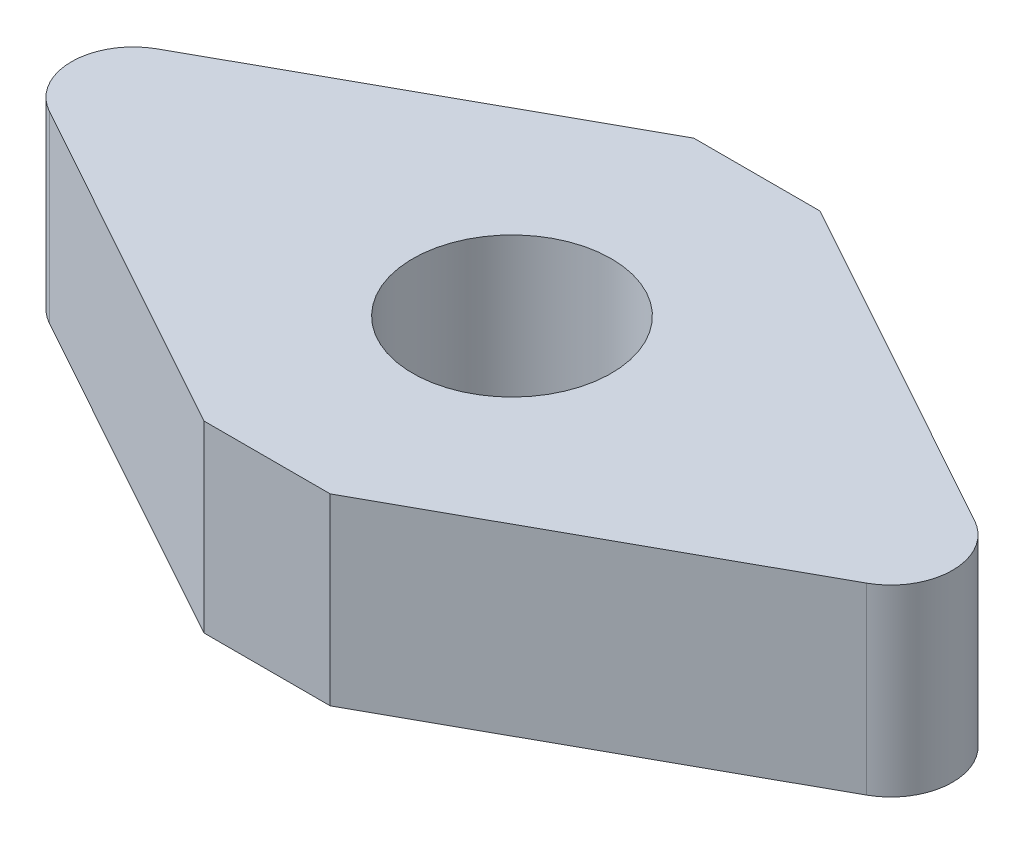
ISO-10303-21;
HEADER;
FILE_DESCRIPTION(('STEP AP214'),'2;1');
FILE_NAME('part.step','',(''),(''),'','','');
FILE_SCHEMA(('AUTOMOTIVE_DESIGN { 1 0 10303 214 1 1 1 1 }'));
ENDSEC;
DATA;
#1=APPLICATION_CONTEXT('core data for automotive mechanical design processes');
#2=APPLICATION_PROTOCOL_DEFINITION('international standard','automotive_design',2000,#1);
#3=PRODUCT_CONTEXT('',#1,'mechanical');
#4=PRODUCT('Part','Part','',(#3));
#5=PRODUCT_RELATED_PRODUCT_CATEGORY('part','',(#4));
#6=PRODUCT_DEFINITION_FORMATION('','',#4);
#7=PRODUCT_DEFINITION_CONTEXT('part definition',#1,'design');
#8=PRODUCT_DEFINITION('design','',#6,#7);
#9=PRODUCT_DEFINITION_SHAPE('','',#8);
#10=(LENGTH_UNIT() NAMED_UNIT(*) SI_UNIT(.MILLI.,.METRE.));
#11=(NAMED_UNIT(*) PLANE_ANGLE_UNIT() SI_UNIT($,.RADIAN.));
#12=(NAMED_UNIT(*) SI_UNIT($,.STERADIAN.) SOLID_ANGLE_UNIT());
#13=UNCERTAINTY_MEASURE_WITH_UNIT(LENGTH_MEASURE(1.E-05),#10,'distance_accuracy_value','');
#14=(GEOMETRIC_REPRESENTATION_CONTEXT(3) GLOBAL_UNCERTAINTY_ASSIGNED_CONTEXT((#13)) GLOBAL_UNIT_ASSIGNED_CONTEXT((#10,
#11,#12)) REPRESENTATION_CONTEXT('',''));
#15=CARTESIAN_POINT('',(0.,0.,0.));
#16=DIRECTION('',(0.,0.,1.));
#17=DIRECTION('',(1.,0.,0.));
#18=AXIS2_PLACEMENT_3D('',#15,#16,#17);
#19=CARTESIAN_POINT('',(-9.82071370639021,4.76,0.));
#20=DIRECTION('',(0.,-1.,0.));
#21=DIRECTION('',(0.,0.,-1.));
#22=AXIS2_PLACEMENT_3D('',#19,#20,#21);
#23=CYLINDRICAL_SURFACE('',#22,1.6);
#24=CARTESIAN_POINT('',(-9.82071370639021,0.,0.));
#25=DIRECTION('',(0.,1.,0.));
#26=DIRECTION('',(0.,0.,-1.));
#27=AXIS2_PLACEMENT_3D('',#24,#25,#26);
#28=CIRCLE('',#27,1.6);
#29=CARTESIAN_POINT('',(-10.5945882156384,0.,-1.40039931588667));
#30=VERTEX_POINT('',#29);
#31=CARTESIAN_POINT('',(-10.5945882156384,0.,1.40039931588667));
#32=VERTEX_POINT('',#31);
#33=EDGE_CURVE('E153',#30,#32,#28,.T.);
#34=ORIENTED_EDGE('',*,*,#33,.T.);
#35=DIRECTION('',(0.,-1.,0.));
#36=VECTOR('',#35,1.);
#37=CARTESIAN_POINT('',(-10.5945882156384,4.76,1.40039931588667));
#38=LINE('',#37,#36);
#39=CARTESIAN_POINT('',(-10.5945882156384,4.76,1.40039931588667));
#40=VERTEX_POINT('',#39);
#41=EDGE_CURVE('E11',#40,#32,#38,.T.);
#42=ORIENTED_EDGE('',*,*,#41,.F.);
#43=CARTESIAN_POINT('',(-9.82071370639021,4.76,0.));
#44=DIRECTION('',(0.,1.,0.));
#45=DIRECTION('',(0.,0.,-1.));
#46=AXIS2_PLACEMENT_3D('',#43,#44,#45);
#47=CIRCLE('',#46,1.6);
#48=CARTESIAN_POINT('',(-10.5945882156384,4.76,-1.40039931588667));
#49=VERTEX_POINT('',#48);
#50=EDGE_CURVE('E174',#49,#40,#47,.T.);
#51=ORIENTED_EDGE('',*,*,#50,.F.);
#52=DIRECTION('',(0.,-1.,0.));
#53=VECTOR('',#52,1.);
#54=CARTESIAN_POINT('',(-10.5945882156384,4.76,-1.40039931588667));
#55=LINE('',#54,#53);
#56=EDGE_CURVE('E149',#49,#30,#55,.T.);
#57=ORIENTED_EDGE('',*,*,#56,.T.);
#58=EDGE_LOOP('',(#34,#42,#51,#57));
#59=FACE_BOUND('',#58,.T.);
#60=ADVANCED_FACE('F39',(#59),#23,.T.);
#61=CARTESIAN_POINT('',(-1.63781637587595,4.76,6.35000000000001));
#62=DIRECTION('',(0.483671568280138,0.,-0.875249572429162));
#63=DIRECTION('',(-0.875249572429163,0.,-0.483671568280138));
#64=AXIS2_PLACEMENT_3D('',#61,#62,#63);
#65=PLANE('',#64);
#66=DIRECTION('',(0.875249572429163,0.,0.483671568280138));
#67=VECTOR('',#66,1.);
#68=CARTESIAN_POINT('',(-1.63781637587595,0.,6.35000000000001));
#69=LINE('',#68,#67);
#70=CARTESIAN_POINT('',(-1.63781637587595,0.,6.35000000000001));
#71=VERTEX_POINT('',#70);
#72=EDGE_CURVE('E156',#32,#71,#69,.T.);
#73=ORIENTED_EDGE('',*,*,#72,.T.);
#74=DIRECTION('',(0.,-1.,0.));
#75=VECTOR('',#74,1.);
#76=CARTESIAN_POINT('',(-1.63781637587595,4.76,6.35000000000001));
#77=LINE('',#76,#75);
#78=CARTESIAN_POINT('',(-1.63781637587595,4.76,6.35000000000001));
#79=VERTEX_POINT('',#78);
#80=EDGE_CURVE('E48',#79,#71,#77,.T.);
#81=ORIENTED_EDGE('',*,*,#80,.F.);
#82=DIRECTION('',(0.875249572429163,0.,0.483671568280138));
#83=VECTOR('',#82,1.);
#84=CARTESIAN_POINT('',(-1.63781637587595,4.76,6.35000000000001));
#85=LINE('',#84,#83);
#86=EDGE_CURVE('E108',#40,#79,#85,.T.);
#87=ORIENTED_EDGE('',*,*,#86,.F.);
#88=ORIENTED_EDGE('',*,*,#41,.T.);
#89=EDGE_LOOP('',(#73,#81,#87,#88));
#90=FACE_BOUND('',#89,.T.);
#91=ADVANCED_FACE('F241',(#90),#65,.F.);
#92=CARTESIAN_POINT('',(1.63781637587596,4.76,6.35000000000001));
#93=DIRECTION('',(0.,0.,-1.));
#94=DIRECTION('',(-1.,0.,0.));
#95=AXIS2_PLACEMENT_3D('',#92,#93,#94);
#96=PLANE('',#95);
#97=DIRECTION('',(1.,0.,0.));
#98=VECTOR('',#97,1.);
#99=CARTESIAN_POINT('',(1.63781637587596,0.,6.35000000000001));
#100=LINE('',#99,#98);
#101=CARTESIAN_POINT('',(1.63781637587596,0.,6.35000000000001));
#102=VERTEX_POINT('',#101);
#103=EDGE_CURVE('E160',#71,#102,#100,.T.);
#104=ORIENTED_EDGE('',*,*,#103,.T.);
#105=DIRECTION('',(0.,-1.,0.));
#106=VECTOR('',#105,1.);
#107=CARTESIAN_POINT('',(1.63781637587596,4.76,6.35000000000001));
#108=LINE('',#107,#106);
#109=CARTESIAN_POINT('',(1.63781637587596,4.76,6.35000000000001));
#110=VERTEX_POINT('',#109);
#111=EDGE_CURVE('E185',#110,#102,#108,.T.);
#112=ORIENTED_EDGE('',*,*,#111,.F.);
#113=DIRECTION('',(1.,0.,0.));
#114=VECTOR('',#113,1.);
#115=CARTESIAN_POINT('',(1.63781637587596,4.76,6.35000000000001));
#116=LINE('',#115,#114);
#117=EDGE_CURVE('E196',#79,#110,#116,.T.);
#118=ORIENTED_EDGE('',*,*,#117,.F.);
#119=ORIENTED_EDGE('',*,*,#80,.T.);
#120=EDGE_LOOP('',(#104,#112,#118,#119));
#121=FACE_BOUND('',#120,.T.);
#122=ADVANCED_FACE('F194',(#121),#96,.F.);
#123=CARTESIAN_POINT('',(10.5945882156384,4.76,1.40039931588667));
#124=DIRECTION('',(-0.483671568280138,0.,-0.875249572429162));
#125=DIRECTION('',(-0.875249572429163,0.,0.483671568280138));
#126=AXIS2_PLACEMENT_3D('',#123,#124,#125);
#127=PLANE('',#126);
#128=DIRECTION('',(0.875249572429162,0.,-0.483671568280138));
#129=VECTOR('',#128,1.);
#130=CARTESIAN_POINT('',(10.5945882156384,0.,1.40039931588667));
#131=LINE('',#130,#129);
#132=CARTESIAN_POINT('',(10.5945882156384,0.,1.40039931588667));
#133=VERTEX_POINT('',#132);
#134=EDGE_CURVE('E162',#102,#133,#131,.T.);
#135=ORIENTED_EDGE('',*,*,#134,.T.);
#136=DIRECTION('',(0.,-1.,0.));
#137=VECTOR('',#136,1.);
#138=CARTESIAN_POINT('',(10.5945882156384,4.76,1.40039931588667));
#139=LINE('',#138,#137);
#140=CARTESIAN_POINT('',(10.5945882156384,4.76,1.40039931588667));
#141=VERTEX_POINT('',#140);
#142=EDGE_CURVE('E181',#141,#133,#139,.T.);
#143=ORIENTED_EDGE('',*,*,#142,.F.);
#144=DIRECTION('',(0.875249572429162,0.,-0.483671568280138));
#145=VECTOR('',#144,1.);
#146=CARTESIAN_POINT('',(10.5945882156384,4.76,1.40039931588667));
#147=LINE('',#146,#145);
#148=EDGE_CURVE('E209',#110,#141,#147,.T.);
#149=ORIENTED_EDGE('',*,*,#148,.F.);
#150=ORIENTED_EDGE('',*,*,#111,.T.);
#151=EDGE_LOOP('',(#135,#143,#149,#150));
#152=FACE_BOUND('',#151,.T.);
#153=ADVANCED_FACE('F204',(#152),#127,.F.);
#154=CARTESIAN_POINT('',(9.82071370639021,4.76,0.));
#155=DIRECTION('',(0.,-1.,0.));
#156=DIRECTION('',(0.,0.,-1.));
#157=AXIS2_PLACEMENT_3D('',#154,#155,#156);
#158=CYLINDRICAL_SURFACE('',#157,1.6);
#159=CARTESIAN_POINT('',(9.82071370639021,0.,0.));
#160=DIRECTION('',(0.,1.,0.));
#161=DIRECTION('',(0.,0.,1.));
#162=AXIS2_PLACEMENT_3D('',#159,#160,#161);
#163=CIRCLE('',#162,1.6);
#164=CARTESIAN_POINT('',(10.5945882156384,0.,-1.40039931588667));
#165=VERTEX_POINT('',#164);
#166=EDGE_CURVE('E165',#133,#165,#163,.T.);
#167=ORIENTED_EDGE('',*,*,#166,.T.);
#168=DIRECTION('',(0.,-1.,0.));
#169=VECTOR('',#168,1.);
#170=CARTESIAN_POINT('',(10.5945882156384,4.76,-1.40039931588667));
#171=LINE('',#170,#169);
#172=CARTESIAN_POINT('',(10.5945882156384,4.76,-1.40039931588667));
#173=VERTEX_POINT('',#172);
#174=EDGE_CURVE('E141',#173,#165,#171,.T.);
#175=ORIENTED_EDGE('',*,*,#174,.F.);
#176=CARTESIAN_POINT('',(9.82071370639021,4.76,0.));
#177=DIRECTION('',(0.,1.,0.));
#178=DIRECTION('',(0.,0.,1.));
#179=AXIS2_PLACEMENT_3D('',#176,#177,#178);
#180=CIRCLE('',#179,1.6);
#181=EDGE_CURVE('E130',#141,#173,#180,.T.);
#182=ORIENTED_EDGE('',*,*,#181,.F.);
#183=ORIENTED_EDGE('',*,*,#142,.T.);
#184=EDGE_LOOP('',(#167,#175,#182,#183));
#185=FACE_BOUND('',#184,.T.);
#186=ADVANCED_FACE('F207',(#185),#158,.T.);
#187=CARTESIAN_POINT('',(1.63781637587596,4.76,-6.35000000000001));
#188=DIRECTION('',(-0.483671568280139,0.,0.875249572429162));
#189=DIRECTION('',(0.875249572429162,0.,0.483671568280139));
#190=AXIS2_PLACEMENT_3D('',#187,#188,#189);
#191=PLANE('',#190);
#192=DIRECTION('',(-0.875249572429162,0.,-0.483671568280138));
#193=VECTOR('',#192,1.);
#194=CARTESIAN_POINT('',(1.63781637587596,0.,-6.35000000000001));
#195=LINE('',#194,#193);
#196=CARTESIAN_POINT('',(1.63781637587596,0.,-6.35000000000001));
#197=VERTEX_POINT('',#196);
#198=EDGE_CURVE('E139',#165,#197,#195,.T.);
#199=ORIENTED_EDGE('',*,*,#198,.T.);
#200=DIRECTION('',(0.,-1.,0.));
#201=VECTOR('',#200,1.);
#202=CARTESIAN_POINT('',(1.63781637587596,4.76,-6.35000000000001));
#203=LINE('',#202,#201);
#204=CARTESIAN_POINT('',(1.63781637587596,4.76,-6.35000000000001));
#205=VERTEX_POINT('',#204);
#206=EDGE_CURVE('E136',#205,#197,#203,.T.);
#207=ORIENTED_EDGE('',*,*,#206,.F.);
#208=DIRECTION('',(-0.875249572429162,0.,-0.483671568280138));
#209=VECTOR('',#208,1.);
#210=CARTESIAN_POINT('',(1.63781637587596,4.76,-6.35000000000001));
#211=LINE('',#210,#209);
#212=EDGE_CURVE('E124',#173,#205,#211,.T.);
#213=ORIENTED_EDGE('',*,*,#212,.F.);
#214=ORIENTED_EDGE('',*,*,#174,.T.);
#215=EDGE_LOOP('',(#199,#207,#213,#214));
#216=FACE_BOUND('',#215,.T.);
#217=ADVANCED_FACE('F137',(#216),#191,.F.);
#218=CARTESIAN_POINT('',(-1.63781637587595,4.76,-6.35000000000001));
#219=DIRECTION('',(0.,0.,1.));
#220=DIRECTION('',(1.,0.,0.));
#221=AXIS2_PLACEMENT_3D('',#218,#219,#220);
#222=PLANE('',#221);
#223=DIRECTION('',(-1.,0.,0.));
#224=VECTOR('',#223,1.);
#225=CARTESIAN_POINT('',(-1.63781637587595,0.,-6.35000000000001));
#226=LINE('',#225,#224);
#227=CARTESIAN_POINT('',(-1.63781637587595,0.,-6.35000000000001));
#228=VERTEX_POINT('',#227);
#229=EDGE_CURVE('E94',#197,#228,#226,.T.);
#230=ORIENTED_EDGE('',*,*,#229,.T.);
#231=DIRECTION('',(0.,-1.,0.));
#232=VECTOR('',#231,1.);
#233=CARTESIAN_POINT('',(-1.63781637587595,4.76,-6.35000000000001));
#234=LINE('',#233,#232);
#235=CARTESIAN_POINT('',(-1.63781637587595,4.76,-6.35000000000001));
#236=VERTEX_POINT('',#235);
#237=EDGE_CURVE('E142',#236,#228,#234,.T.);
#238=ORIENTED_EDGE('',*,*,#237,.F.);
#239=DIRECTION('',(-1.,0.,0.));
#240=VECTOR('',#239,1.);
#241=CARTESIAN_POINT('',(-1.63781637587595,4.76,-6.35000000000001));
#242=LINE('',#241,#240);
#243=EDGE_CURVE('E128',#205,#236,#242,.T.);
#244=ORIENTED_EDGE('',*,*,#243,.F.);
#245=ORIENTED_EDGE('',*,*,#206,.T.);
#246=EDGE_LOOP('',(#230,#238,#244,#245));
#247=FACE_BOUND('',#246,.T.);
#248=ADVANCED_FACE('F144',(#247),#222,.F.);
#249=CARTESIAN_POINT('',(-10.5945882156384,4.76,-1.40039931588667));
#250=DIRECTION('',(0.483671568280138,0.,0.875249572429162));
#251=DIRECTION('',(0.875249572429163,0.,-0.483671568280138));
#252=AXIS2_PLACEMENT_3D('',#249,#250,#251);
#253=PLANE('',#252);
#254=DIRECTION('',(-0.875249572429163,0.,0.483671568280138));
#255=VECTOR('',#254,1.);
#256=CARTESIAN_POINT('',(-10.5945882156384,0.,-1.40039931588667));
#257=LINE('',#256,#255);
#258=EDGE_CURVE('E100',#228,#30,#257,.T.);
#259=ORIENTED_EDGE('',*,*,#258,.T.);
#260=ORIENTED_EDGE('',*,*,#56,.F.);
#261=DIRECTION('',(-0.875249572429163,0.,0.483671568280138));
#262=VECTOR('',#261,1.);
#263=CARTESIAN_POINT('',(-10.5945882156384,4.76,-1.40039931588667));
#264=LINE('',#263,#262);
#265=EDGE_CURVE('E59',#236,#49,#264,.T.);
#266=ORIENTED_EDGE('',*,*,#265,.F.);
#267=ORIENTED_EDGE('',*,*,#237,.T.);
#268=EDGE_LOOP('',(#259,#260,#266,#267));
#269=FACE_BOUND('',#268,.T.);
#270=ADVANCED_FACE('F237',(#269),#253,.F.);
#271=CARTESIAN_POINT('',(-9.82071370639021,4.76,0.));
#272=DIRECTION('',(0.,-1.,0.));
#273=DIRECTION('',(0.,0.,-1.));
#274=AXIS2_PLACEMENT_3D('',#271,#272,#273);
#275=PLANE('',#274);
#276=CARTESIAN_POINT('',(0.,4.76,0.));
#277=DIRECTION('',(0.,-1.,0.));
#278=DIRECTION('',(0.,0.,-1.));
#279=AXIS2_PLACEMENT_3D('',#276,#277,#278);
#280=CIRCLE('',#279,2.575);
#281=CARTESIAN_POINT('',(0.,4.76,-2.575));
#282=VERTEX_POINT('',#281);
#283=EDGE_CURVE('E157',#282,#282,#280,.T.);
#284=ORIENTED_EDGE('',*,*,#283,.T.);
#285=EDGE_LOOP('',(#284));
#286=FACE_BOUND('',#285,.T.);
#287=ORIENTED_EDGE('',*,*,#50,.T.);
#288=ORIENTED_EDGE('',*,*,#86,.T.);
#289=ORIENTED_EDGE('',*,*,#117,.T.);
#290=ORIENTED_EDGE('',*,*,#148,.T.);
#291=ORIENTED_EDGE('',*,*,#181,.T.);
#292=ORIENTED_EDGE('',*,*,#212,.T.);
#293=ORIENTED_EDGE('',*,*,#243,.T.);
#294=ORIENTED_EDGE('',*,*,#265,.T.);
#295=EDGE_LOOP('',(#287,#288,#289,#290,#291,#292,#293,#294));
#296=FACE_BOUND('',#295,.T.);
#297=ADVANCED_FACE('F126',(#286,#296),#275,.F.);
#298=CARTESIAN_POINT('',(-9.82071370639021,0.,0.));
#299=DIRECTION('',(0.,-1.,0.));
#300=DIRECTION('',(0.,0.,-1.));
#301=AXIS2_PLACEMENT_3D('',#298,#299,#300);
#302=PLANE('',#301);
#303=CARTESIAN_POINT('',(0.,0.,0.));
#304=DIRECTION('',(0.,-1.,0.));
#305=DIRECTION('',(0.,0.,-1.));
#306=AXIS2_PLACEMENT_3D('',#303,#304,#305);
#307=CIRCLE('',#306,2.575);
#308=CARTESIAN_POINT('',(0.,0.,-2.575));
#309=VERTEX_POINT('',#308);
#310=EDGE_CURVE('E218',#309,#309,#307,.T.);
#311=ORIENTED_EDGE('',*,*,#310,.F.);
#312=EDGE_LOOP('',(#311));
#313=FACE_BOUND('',#312,.T.);
#314=ORIENTED_EDGE('',*,*,#33,.F.);
#315=ORIENTED_EDGE('',*,*,#258,.F.);
#316=ORIENTED_EDGE('',*,*,#229,.F.);
#317=ORIENTED_EDGE('',*,*,#198,.F.);
#318=ORIENTED_EDGE('',*,*,#166,.F.);
#319=ORIENTED_EDGE('',*,*,#134,.F.);
#320=ORIENTED_EDGE('',*,*,#103,.F.);
#321=ORIENTED_EDGE('',*,*,#72,.F.);
#322=EDGE_LOOP('',(#314,#315,#316,#317,#318,#319,#320,#321));
#323=FACE_BOUND('',#322,.T.);
#324=ADVANCED_FACE('F200',(#313,#323),#302,.T.);
#325=CARTESIAN_POINT('',(0.,4.76,0.));
#326=DIRECTION('',(0.,-1.,0.));
#327=DIRECTION('',(0.,0.,-1.));
#328=AXIS2_PLACEMENT_3D('',#325,#326,#327);
#329=CYLINDRICAL_SURFACE('',#328,2.575);
#330=ORIENTED_EDGE('',*,*,#283,.F.);
#331=EDGE_LOOP('',(#330));
#332=FACE_BOUND('',#331,.T.);
#333=ORIENTED_EDGE('',*,*,#310,.T.);
#334=EDGE_LOOP('',(#333));
#335=FACE_BOUND('',#334,.T.);
#336=ADVANCED_FACE('F226',(#332,#335),#329,.F.);
#337=CLOSED_SHELL('',(#60,#91,#122,#153,#186,#217,#248,#270,#297,#324,#336));
#338=MANIFOLD_SOLID_BREP('B2',#337);
#339=ADVANCED_BREP_SHAPE_REPRESENTATION('',(#18,#338),#14);
#340=SHAPE_DEFINITION_REPRESENTATION(#9,#339);
ENDSEC;
END-ISO-10303-21;
